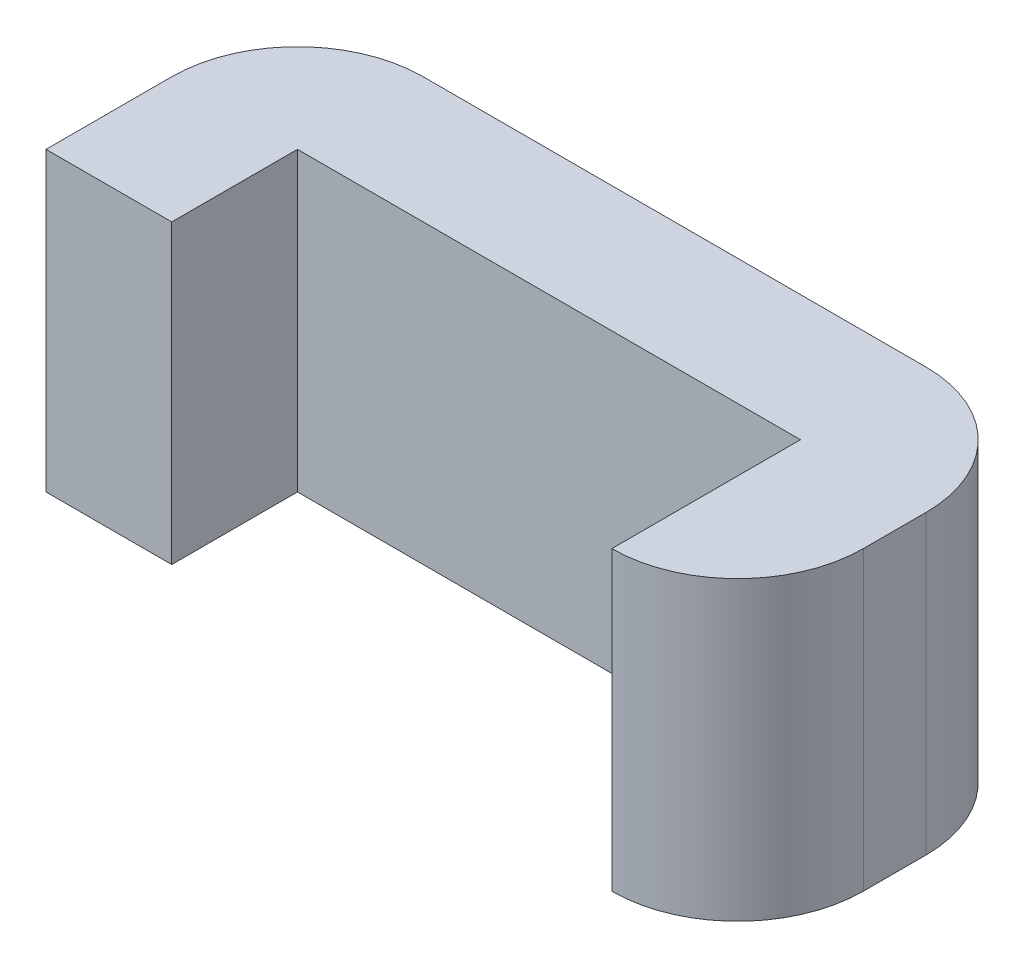
ISO-10303-21;
HEADER;
FILE_DESCRIPTION(('STEP AP214'),'2;1');
FILE_NAME('part.step','',(''),(''),'','','');
FILE_SCHEMA(('AUTOMOTIVE_DESIGN { 1 0 10303 214 1 1 1 1 }'));
ENDSEC;
DATA;
#1=APPLICATION_CONTEXT('core data for automotive mechanical design processes');
#2=APPLICATION_PROTOCOL_DEFINITION('international standard','automotive_design',2000,#1);
#3=PRODUCT_CONTEXT('',#1,'mechanical');
#4=PRODUCT('Part','Part','',(#3));
#5=PRODUCT_RELATED_PRODUCT_CATEGORY('part','',(#4));
#6=PRODUCT_DEFINITION_FORMATION('','',#4);
#7=PRODUCT_DEFINITION_CONTEXT('part definition',#1,'design');
#8=PRODUCT_DEFINITION('design','',#6,#7);
#9=PRODUCT_DEFINITION_SHAPE('','',#8);
#10=(LENGTH_UNIT() NAMED_UNIT(*) SI_UNIT(.MILLI.,.METRE.));
#11=(NAMED_UNIT(*) PLANE_ANGLE_UNIT() SI_UNIT($,.RADIAN.));
#12=(NAMED_UNIT(*) SI_UNIT($,.STERADIAN.) SOLID_ANGLE_UNIT());
#13=UNCERTAINTY_MEASURE_WITH_UNIT(LENGTH_MEASURE(1.E-05),#10,'distance_accuracy_value','');
#14=(GEOMETRIC_REPRESENTATION_CONTEXT(3) GLOBAL_UNCERTAINTY_ASSIGNED_CONTEXT((#13)) GLOBAL_UNIT_ASSIGNED_CONTEXT((#10,
#11,#12)) REPRESENTATION_CONTEXT('',''));
#15=CARTESIAN_POINT('',(0.,0.,0.));
#16=DIRECTION('',(0.,0.,1.));
#17=DIRECTION('',(1.,0.,0.));
#18=AXIS2_PLACEMENT_3D('',#15,#16,#17);
#19=CARTESIAN_POINT('',(-0.5,-0.295,0.25));
#20=DIRECTION('',(0.,0.,-1.));
#21=DIRECTION('',(-1.,0.,0.));
#22=AXIS2_PLACEMENT_3D('',#19,#20,#21);
#23=PLANE('',#22);
#24=DIRECTION('',(0.,1.,0.));
#25=VECTOR('',#24,1.);
#26=CARTESIAN_POINT('',(0.5,-0.295,0.25));
#27=LINE('',#26,#25);
#28=CARTESIAN_POINT('',(0.5,-0.295,0.25));
#29=VERTEX_POINT('',#28);
#30=CARTESIAN_POINT('',(0.5,0.295,0.25));
#31=VERTEX_POINT('',#30);
#32=EDGE_CURVE('E124',#29,#31,#27,.T.);
#33=ORIENTED_EDGE('',*,*,#32,.T.);
#34=DIRECTION('',(1.,0.,0.));
#35=VECTOR('',#34,1.);
#36=CARTESIAN_POINT('',(0.5,0.295,0.25));
#37=LINE('',#36,#35);
#38=CARTESIAN_POINT('',(-0.5,0.295,0.25));
#39=VERTEX_POINT('',#38);
#40=EDGE_CURVE('E111',#31,#39,#37,.F.);
#41=ORIENTED_EDGE('',*,*,#40,.T.);
#42=DIRECTION('',(0.,1.,0.));
#43=VECTOR('',#42,1.);
#44=CARTESIAN_POINT('',(-0.5,-0.295,0.25));
#45=LINE('',#44,#43);
#46=CARTESIAN_POINT('',(-0.5,-0.295,0.25));
#47=VERTEX_POINT('',#46);
#48=EDGE_CURVE('E107',#39,#47,#45,.F.);
#49=ORIENTED_EDGE('',*,*,#48,.T.);
#50=DIRECTION('',(1.,0.,0.));
#51=VECTOR('',#50,1.);
#52=CARTESIAN_POINT('',(0.5,-0.295,0.25));
#53=LINE('',#52,#51);
#54=EDGE_CURVE('E125',#29,#47,#53,.F.);
#55=ORIENTED_EDGE('',*,*,#54,.F.);
#56=EDGE_LOOP('',(#33,#41,#49,#55));
#57=FACE_BOUND('',#56,.T.);
#58=ADVANCED_FACE('F16',(#57),#23,.F.);
#59=CARTESIAN_POINT('',(-0.5,-0.295,0.5));
#60=DIRECTION('',(-1.,0.,0.));
#61=DIRECTION('',(0.,0.,1.));
#62=AXIS2_PLACEMENT_3D('',#59,#60,#61);
#63=PLANE('',#62);
#64=ORIENTED_EDGE('',*,*,#48,.F.);
#65=DIRECTION('',(0.,0.,-1.));
#66=VECTOR('',#65,1.);
#67=CARTESIAN_POINT('',(-0.5,0.295,0.25));
#68=LINE('',#67,#66);
#69=CARTESIAN_POINT('',(-0.5,0.295,0.5));
#70=VERTEX_POINT('',#69);
#71=EDGE_CURVE('E119',#39,#70,#68,.F.);
#72=ORIENTED_EDGE('',*,*,#71,.T.);
#73=DIRECTION('',(0.,1.,0.));
#74=VECTOR('',#73,1.);
#75=CARTESIAN_POINT('',(-0.5,-0.295,0.5));
#76=LINE('',#75,#74);
#77=CARTESIAN_POINT('',(-0.5,-0.295,0.5));
#78=VERTEX_POINT('',#77);
#79=EDGE_CURVE('E176',#70,#78,#76,.F.);
#80=ORIENTED_EDGE('',*,*,#79,.T.);
#81=DIRECTION('',(0.,0.,-1.));
#82=VECTOR('',#81,1.);
#83=CARTESIAN_POINT('',(-0.5,-0.295,0.25));
#84=LINE('',#83,#82);
#85=EDGE_CURVE('E167',#47,#78,#84,.F.);
#86=ORIENTED_EDGE('',*,*,#85,.F.);
#87=EDGE_LOOP('',(#64,#72,#80,#86));
#88=FACE_BOUND('',#87,.T.);
#89=ADVANCED_FACE('F226',(#88),#63,.F.);
#90=CARTESIAN_POINT('',(-0.75,-0.295,0.5));
#91=DIRECTION('',(0.,0.,-1.));
#92=DIRECTION('',(-1.,0.,0.));
#93=AXIS2_PLACEMENT_3D('',#90,#91,#92);
#94=PLANE('',#93);
#95=ORIENTED_EDGE('',*,*,#79,.F.);
#96=DIRECTION('',(1.,0.,0.));
#97=VECTOR('',#96,1.);
#98=CARTESIAN_POINT('',(0.5,0.295,0.5));
#99=LINE('',#98,#97);
#100=CARTESIAN_POINT('',(-0.75,0.295,0.5));
#101=VERTEX_POINT('',#100);
#102=EDGE_CURVE('E144',#70,#101,#99,.F.);
#103=ORIENTED_EDGE('',*,*,#102,.T.);
#104=DIRECTION('',(0.,1.,0.));
#105=VECTOR('',#104,1.);
#106=CARTESIAN_POINT('',(-0.75,-0.295,0.5));
#107=LINE('',#106,#105);
#108=CARTESIAN_POINT('',(-0.75,-0.295,0.5));
#109=VERTEX_POINT('',#108);
#110=EDGE_CURVE('E183',#101,#109,#107,.F.);
#111=ORIENTED_EDGE('',*,*,#110,.T.);
#112=DIRECTION('',(1.,0.,0.));
#113=VECTOR('',#112,1.);
#114=CARTESIAN_POINT('',(0.5,-0.295,0.5));
#115=LINE('',#114,#113);
#116=EDGE_CURVE('E85',#78,#109,#115,.F.);
#117=ORIENTED_EDGE('',*,*,#116,.F.);
#118=EDGE_LOOP('',(#95,#103,#111,#117));
#119=FACE_BOUND('',#118,.T.);
#120=ADVANCED_FACE('F225',(#119),#94,.F.);
#121=CARTESIAN_POINT('',(-0.75,-0.295,0.25));
#122=DIRECTION('',(1.,0.,0.));
#123=DIRECTION('',(0.,0.,-1.));
#124=AXIS2_PLACEMENT_3D('',#121,#122,#123);
#125=PLANE('',#124);
#126=ORIENTED_EDGE('',*,*,#110,.F.);
#127=DIRECTION('',(0.,0.,-1.));
#128=VECTOR('',#127,1.);
#129=CARTESIAN_POINT('',(-0.75,0.295,0.25));
#130=LINE('',#129,#128);
#131=CARTESIAN_POINT('',(-0.75,0.295,0.25));
#132=VERTEX_POINT('',#131);
#133=EDGE_CURVE('E147',#101,#132,#130,.T.);
#134=ORIENTED_EDGE('',*,*,#133,.T.);
#135=DIRECTION('',(0.,-1.,0.));
#136=VECTOR('',#135,1.);
#137=CARTESIAN_POINT('',(-0.75,-0.295,0.25));
#138=LINE('',#137,#136);
#139=CARTESIAN_POINT('',(-0.75,-0.295,0.25));
#140=VERTEX_POINT('',#139);
#141=EDGE_CURVE('E133',#140,#132,#138,.F.);
#142=ORIENTED_EDGE('',*,*,#141,.F.);
#143=DIRECTION('',(0.,0.,-1.));
#144=VECTOR('',#143,1.);
#145=CARTESIAN_POINT('',(-0.75,-0.295,0.25));
#146=LINE('',#145,#144);
#147=EDGE_CURVE('E79',#109,#140,#146,.T.);
#148=ORIENTED_EDGE('',*,*,#147,.F.);
#149=EDGE_LOOP('',(#126,#134,#142,#148));
#150=FACE_BOUND('',#149,.T.);
#151=ADVANCED_FACE('F223',(#150),#125,.F.);
#152=CARTESIAN_POINT('',(0.75,-0.295,0.375));
#153=DIRECTION('',(-1.,0.,0.));
#154=DIRECTION('',(0.,0.,1.));
#155=AXIS2_PLACEMENT_3D('',#152,#153,#154);
#156=PLANE('',#155);
#157=DIRECTION('',(0.,-1.,0.));
#158=VECTOR('',#157,1.);
#159=CARTESIAN_POINT('',(0.75,-0.295,0.25));
#160=LINE('',#159,#158);
#161=CARTESIAN_POINT('',(0.75,0.295,0.25));
#162=VERTEX_POINT('',#161);
#163=CARTESIAN_POINT('',(0.75,-0.295,0.25));
#164=VERTEX_POINT('',#163);
#165=EDGE_CURVE('E73',#162,#164,#160,.T.);
#166=ORIENTED_EDGE('',*,*,#165,.F.);
#167=DIRECTION('',(0.,0.,-1.));
#168=VECTOR('',#167,1.);
#169=CARTESIAN_POINT('',(0.75,0.295,0.25));
#170=LINE('',#169,#168);
#171=CARTESIAN_POINT('',(0.75,0.295,0.375));
#172=VERTEX_POINT('',#171);
#173=EDGE_CURVE('E138',#162,#172,#170,.F.);
#174=ORIENTED_EDGE('',*,*,#173,.T.);
#175=DIRECTION('',(0.,-1.,0.));
#176=VECTOR('',#175,1.);
#177=CARTESIAN_POINT('',(0.75,-0.295,0.375));
#178=LINE('',#177,#176);
#179=CARTESIAN_POINT('',(0.75,-0.295,0.375));
#180=VERTEX_POINT('',#179);
#181=EDGE_CURVE('E189',#180,#172,#178,.F.);
#182=ORIENTED_EDGE('',*,*,#181,.F.);
#183=DIRECTION('',(0.,0.,-1.));
#184=VECTOR('',#183,1.);
#185=CARTESIAN_POINT('',(0.75,-0.295,0.25));
#186=LINE('',#185,#184);
#187=EDGE_CURVE('E159',#164,#180,#186,.F.);
#188=ORIENTED_EDGE('',*,*,#187,.F.);
#189=EDGE_LOOP('',(#166,#174,#182,#188));
#190=FACE_BOUND('',#189,.T.);
#191=ADVANCED_FACE('F215',(#190),#156,.F.);
#192=CARTESIAN_POINT('',(0.5,-0.295,0.375));
#193=DIRECTION('',(0.,-1.,0.));
#194=DIRECTION('',(0.,0.,-1.));
#195=AXIS2_PLACEMENT_3D('',#192,#193,#194);
#196=CYLINDRICAL_SURFACE('',#195,0.25);
#197=CARTESIAN_POINT('',(0.5,0.295,0.375));
#198=DIRECTION('',(0.,-1.,0.));
#199=DIRECTION('',(0.,0.,-1.));
#200=AXIS2_PLACEMENT_3D('',#197,#198,#199);
#201=CIRCLE('',#200,0.25);
#202=CARTESIAN_POINT('',(0.5,0.295,0.625));
#203=VERTEX_POINT('',#202);
#204=EDGE_CURVE('E134',#172,#203,#201,.T.);
#205=ORIENTED_EDGE('',*,*,#204,.T.);
#206=DIRECTION('',(0.,1.,0.));
#207=VECTOR('',#206,1.);
#208=CARTESIAN_POINT('',(0.5,-0.295,0.625));
#209=LINE('',#208,#207);
#210=CARTESIAN_POINT('',(0.5,-0.295,0.625));
#211=VERTEX_POINT('',#210);
#212=EDGE_CURVE('E128',#203,#211,#209,.F.);
#213=ORIENTED_EDGE('',*,*,#212,.T.);
#214=CARTESIAN_POINT('',(0.5,-0.295,0.375));
#215=DIRECTION('',(0.,-1.,0.));
#216=DIRECTION('',(0.,0.,-1.));
#217=AXIS2_PLACEMENT_3D('',#214,#215,#216);
#218=CIRCLE('',#217,0.25);
#219=EDGE_CURVE('E155',#180,#211,#218,.T.);
#220=ORIENTED_EDGE('',*,*,#219,.F.);
#221=ORIENTED_EDGE('',*,*,#181,.T.);
#222=EDGE_LOOP('',(#205,#213,#220,#221));
#223=FACE_BOUND('',#222,.T.);
#224=ADVANCED_FACE('F217',(#223),#196,.T.);
#225=CARTESIAN_POINT('',(0.5,-0.295,0.25));
#226=DIRECTION('',(1.,0.,0.));
#227=DIRECTION('',(0.,0.,-1.));
#228=AXIS2_PLACEMENT_3D('',#225,#226,#227);
#229=PLANE('',#228);
#230=DIRECTION('',(0.,0.,-1.));
#231=VECTOR('',#230,1.);
#232=CARTESIAN_POINT('',(0.5,-0.295,0.25));
#233=LINE('',#232,#231);
#234=EDGE_CURVE('E158',#211,#29,#233,.T.);
#235=ORIENTED_EDGE('',*,*,#234,.F.);
#236=ORIENTED_EDGE('',*,*,#212,.F.);
#237=DIRECTION('',(0.,0.,-1.));
#238=VECTOR('',#237,1.);
#239=CARTESIAN_POINT('',(0.5,0.295,0.25));
#240=LINE('',#239,#238);
#241=EDGE_CURVE('E116',#203,#31,#240,.T.);
#242=ORIENTED_EDGE('',*,*,#241,.T.);
#243=ORIENTED_EDGE('',*,*,#32,.F.);
#244=EDGE_LOOP('',(#235,#236,#242,#243));
#245=FACE_BOUND('',#244,.T.);
#246=ADVANCED_FACE('F130',(#245),#229,.F.);
#247=CARTESIAN_POINT('',(0.5,-0.295,0.25));
#248=DIRECTION('',(0.,-1.,0.));
#249=DIRECTION('',(0.,0.,-1.));
#250=AXIS2_PLACEMENT_3D('',#247,#248,#249);
#251=CYLINDRICAL_SURFACE('',#250,0.25);
#252=CARTESIAN_POINT('',(0.5,0.295,0.25));
#253=DIRECTION('',(0.,-1.,0.));
#254=DIRECTION('',(0.,0.,-1.));
#255=AXIS2_PLACEMENT_3D('',#252,#253,#254);
#256=CIRCLE('',#255,0.25);
#257=CARTESIAN_POINT('',(0.5,0.295,0.));
#258=VERTEX_POINT('',#257);
#259=EDGE_CURVE('E19',#258,#162,#256,.T.);
#260=ORIENTED_EDGE('',*,*,#259,.T.);
#261=ORIENTED_EDGE('',*,*,#165,.T.);
#262=CARTESIAN_POINT('',(0.5,-0.295,0.25));
#263=DIRECTION('',(0.,-1.,0.));
#264=DIRECTION('',(0.,0.,-1.));
#265=AXIS2_PLACEMENT_3D('',#262,#263,#264);
#266=CIRCLE('',#265,0.25);
#267=CARTESIAN_POINT('',(0.5,-0.295,0.));
#268=VERTEX_POINT('',#267);
#269=EDGE_CURVE('E160',#268,#164,#266,.T.);
#270=ORIENTED_EDGE('',*,*,#269,.F.);
#271=DIRECTION('',(0.,1.,0.));
#272=VECTOR('',#271,1.);
#273=CARTESIAN_POINT('',(0.5,-0.295,0.));
#274=LINE('',#273,#272);
#275=EDGE_CURVE('E63',#268,#258,#274,.T.);
#276=ORIENTED_EDGE('',*,*,#275,.T.);
#277=EDGE_LOOP('',(#260,#261,#270,#276));
#278=FACE_BOUND('',#277,.T.);
#279=ADVANCED_FACE('F218',(#278),#251,.T.);
#280=CARTESIAN_POINT('',(0.5,0.295,0.25));
#281=DIRECTION('',(0.,-1.,0.));
#282=DIRECTION('',(0.,0.,-1.));
#283=AXIS2_PLACEMENT_3D('',#280,#281,#282);
#284=PLANE('',#283);
#285=ORIENTED_EDGE('',*,*,#241,.F.);
#286=ORIENTED_EDGE('',*,*,#204,.F.);
#287=ORIENTED_EDGE('',*,*,#173,.F.);
#288=ORIENTED_EDGE('',*,*,#259,.F.);
#289=DIRECTION('',(1.,0.,0.));
#290=VECTOR('',#289,1.);
#291=CARTESIAN_POINT('',(0.5,0.295,0.));
#292=LINE('',#291,#290);
#293=CARTESIAN_POINT('',(-0.5,0.295,0.));
#294=VERTEX_POINT('',#293);
#295=EDGE_CURVE('E203',#258,#294,#292,.F.);
#296=ORIENTED_EDGE('',*,*,#295,.T.);
#297=CARTESIAN_POINT('',(-0.5,0.295,0.25));
#298=DIRECTION('',(0.,-1.,0.));
#299=DIRECTION('',(0.,0.,-1.));
#300=AXIS2_PLACEMENT_3D('',#297,#298,#299);
#301=CIRCLE('',#300,0.25);
#302=EDGE_CURVE('E136',#132,#294,#301,.T.);
#303=ORIENTED_EDGE('',*,*,#302,.F.);
#304=ORIENTED_EDGE('',*,*,#133,.F.);
#305=ORIENTED_EDGE('',*,*,#102,.F.);
#306=ORIENTED_EDGE('',*,*,#71,.F.);
#307=ORIENTED_EDGE('',*,*,#40,.F.);
#308=EDGE_LOOP('',(#285,#286,#287,#288,#296,#303,#304,#305,#306,#307));
#309=FACE_BOUND('',#308,.T.);
#310=ADVANCED_FACE('F113',(#309),#284,.F.);
#311=CARTESIAN_POINT('',(-0.5,-0.295,0.25));
#312=DIRECTION('',(0.,-1.,0.));
#313=DIRECTION('',(0.,0.,-1.));
#314=AXIS2_PLACEMENT_3D('',#311,#312,#313);
#315=CYLINDRICAL_SURFACE('',#314,0.25);
#316=ORIENTED_EDGE('',*,*,#302,.T.);
#317=DIRECTION('',(0.,1.,0.));
#318=VECTOR('',#317,1.);
#319=CARTESIAN_POINT('',(-0.5,-0.295,0.));
#320=LINE('',#319,#318);
#321=CARTESIAN_POINT('',(-0.5,-0.295,0.));
#322=VERTEX_POINT('',#321);
#323=EDGE_CURVE('E25',#294,#322,#320,.F.);
#324=ORIENTED_EDGE('',*,*,#323,.T.);
#325=CARTESIAN_POINT('',(-0.5,-0.295,0.25));
#326=DIRECTION('',(0.,-1.,0.));
#327=DIRECTION('',(0.,0.,-1.));
#328=AXIS2_PLACEMENT_3D('',#325,#326,#327);
#329=CIRCLE('',#328,0.25);
#330=EDGE_CURVE('E33',#140,#322,#329,.T.);
#331=ORIENTED_EDGE('',*,*,#330,.F.);
#332=ORIENTED_EDGE('',*,*,#141,.T.);
#333=EDGE_LOOP('',(#316,#324,#331,#332));
#334=FACE_BOUND('',#333,.T.);
#335=ADVANCED_FACE('F220',(#334),#315,.T.);
#336=CARTESIAN_POINT('',(0.5,-0.295,0.25));
#337=DIRECTION('',(0.,-1.,0.));
#338=DIRECTION('',(0.,0.,-1.));
#339=AXIS2_PLACEMENT_3D('',#336,#337,#338);
#340=PLANE('',#339);
#341=ORIENTED_EDGE('',*,*,#219,.T.);
#342=ORIENTED_EDGE('',*,*,#234,.T.);
#343=ORIENTED_EDGE('',*,*,#54,.T.);
#344=ORIENTED_EDGE('',*,*,#85,.T.);
#345=ORIENTED_EDGE('',*,*,#116,.T.);
#346=ORIENTED_EDGE('',*,*,#147,.T.);
#347=ORIENTED_EDGE('',*,*,#330,.T.);
#348=DIRECTION('',(1.,0.,0.));
#349=VECTOR('',#348,1.);
#350=CARTESIAN_POINT('',(0.5,-0.295,0.));
#351=LINE('',#350,#349);
#352=EDGE_CURVE('E11',#322,#268,#351,.T.);
#353=ORIENTED_EDGE('',*,*,#352,.T.);
#354=ORIENTED_EDGE('',*,*,#269,.T.);
#355=ORIENTED_EDGE('',*,*,#187,.T.);
#356=EDGE_LOOP('',(#341,#342,#343,#344,#345,#346,#347,#353,#354,#355));
#357=FACE_BOUND('',#356,.T.);
#358=ADVANCED_FACE('F212',(#357),#340,.T.);
#359=CARTESIAN_POINT('',(0.5,-0.295,0.));
#360=DIRECTION('',(0.,0.,1.));
#361=DIRECTION('',(1.,0.,0.));
#362=AXIS2_PLACEMENT_3D('',#359,#360,#361);
#363=PLANE('',#362);
#364=ORIENTED_EDGE('',*,*,#323,.F.);
#365=ORIENTED_EDGE('',*,*,#295,.F.);
#366=ORIENTED_EDGE('',*,*,#275,.F.);
#367=ORIENTED_EDGE('',*,*,#352,.F.);
#368=EDGE_LOOP('',(#364,#365,#366,#367));
#369=FACE_BOUND('',#368,.T.);
#370=ADVANCED_FACE('F219',(#369),#363,.F.);
#371=CLOSED_SHELL('',(#58,#89,#120,#151,#191,#224,#246,#279,#310,#335,#358,#370));
#372=MANIFOLD_SOLID_BREP('B1',#371);
#373=ADVANCED_BREP_SHAPE_REPRESENTATION('',(#18,#372),#14);
#374=SHAPE_DEFINITION_REPRESENTATION(#9,#373);
ENDSEC;
END-ISO-10303-21;
